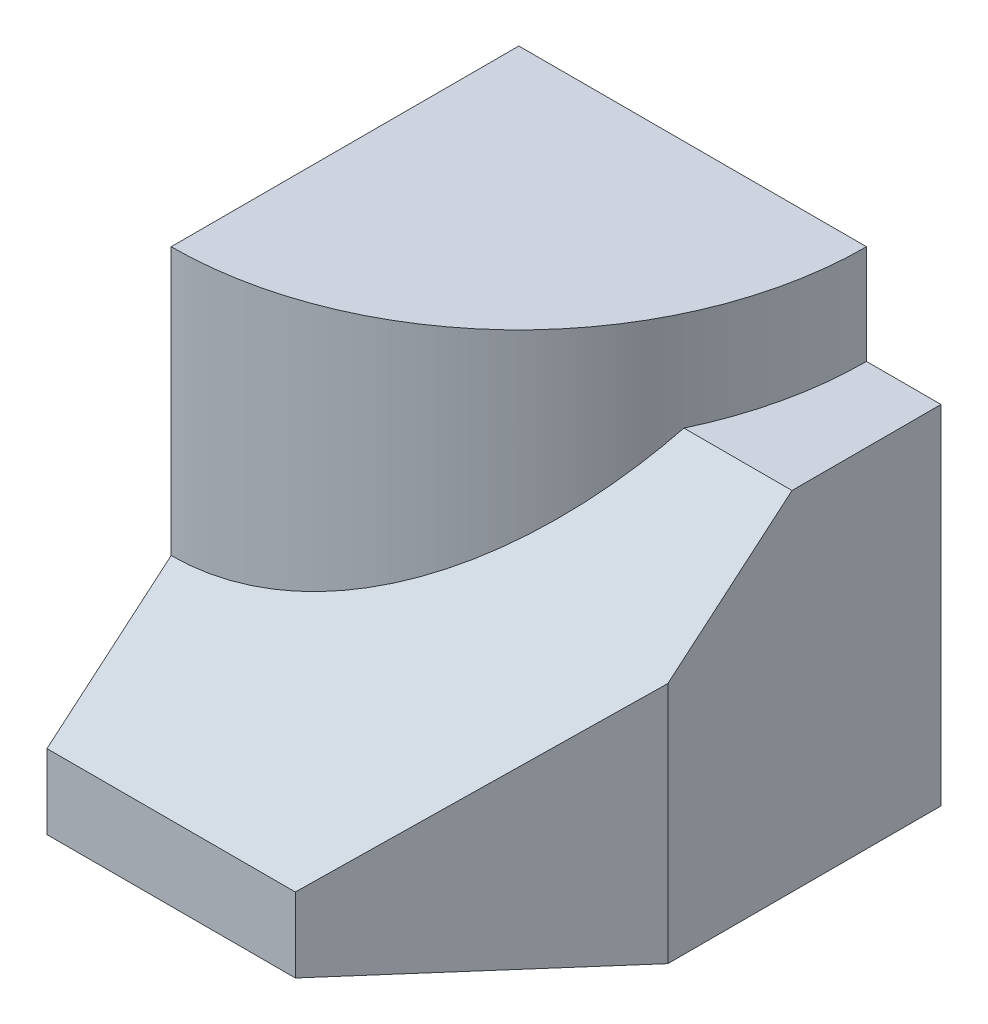
ISO-10303-21;
HEADER;
FILE_DESCRIPTION(('STEP AP214'),'2;1');
FILE_NAME('part.step','',(''),(''),'','','');
FILE_SCHEMA(('AUTOMOTIVE_DESIGN { 1 0 10303 214 1 1 1 1 }'));
ENDSEC;
DATA;
#1=APPLICATION_CONTEXT('core data for automotive mechanical design processes');
#2=APPLICATION_PROTOCOL_DEFINITION('international standard','automotive_design',2000,#1);
#3=PRODUCT_CONTEXT('',#1,'mechanical');
#4=PRODUCT('Part','Part','',(#3));
#5=PRODUCT_RELATED_PRODUCT_CATEGORY('part','',(#4));
#6=PRODUCT_DEFINITION_FORMATION('','',#4);
#7=PRODUCT_DEFINITION_CONTEXT('part definition',#1,'design');
#8=PRODUCT_DEFINITION('design','',#6,#7);
#9=PRODUCT_DEFINITION_SHAPE('','',#8);
#10=(LENGTH_UNIT() NAMED_UNIT(*) SI_UNIT(.MILLI.,.METRE.));
#11=(NAMED_UNIT(*) PLANE_ANGLE_UNIT() SI_UNIT($,.RADIAN.));
#12=(NAMED_UNIT(*) SI_UNIT($,.STERADIAN.) SOLID_ANGLE_UNIT());
#13=UNCERTAINTY_MEASURE_WITH_UNIT(LENGTH_MEASURE(1.E-05),#10,'distance_accuracy_value','');
#14=(GEOMETRIC_REPRESENTATION_CONTEXT(3) GLOBAL_UNCERTAINTY_ASSIGNED_CONTEXT((#13)) GLOBAL_UNIT_ASSIGNED_CONTEXT((#10,
#11,#12)) REPRESENTATION_CONTEXT('',''));
#15=CARTESIAN_POINT('',(0.,0.,0.));
#16=DIRECTION('',(0.,0.,1.));
#17=DIRECTION('',(1.,0.,0.));
#18=AXIS2_PLACEMENT_3D('',#15,#16,#17);
#19=CARTESIAN_POINT('',(0.,0.,0.));
#20=DIRECTION('',(0.,1.,0.));
#21=DIRECTION('',(0.,0.,1.));
#22=AXIS2_PLACEMENT_3D('',#19,#20,#21);
#23=PLANE('',#22);
#24=DIRECTION('',(-0.658504607868518,0.,0.752576694706878));
#25=VECTOR('',#24,1.);
#26=CARTESIAN_POINT('',(85.,0.,55.));
#27=LINE('',#26,#25);
#28=CARTESIAN_POINT('',(85.,0.,55.));
#29=VERTEX_POINT('',#28);
#30=CARTESIAN_POINT('',(50.,0.,95.));
#31=VERTEX_POINT('',#30);
#32=EDGE_CURVE('E46',#29,#31,#27,.T.);
#33=ORIENTED_EDGE('',*,*,#32,.T.);
#34=DIRECTION('',(-1.,0.,0.));
#35=VECTOR('',#34,1.);
#36=CARTESIAN_POINT('',(85.,0.,95.));
#37=LINE('',#36,#35);
#38=CARTESIAN_POINT('',(0.,0.,95.));
#39=VERTEX_POINT('',#38);
#40=EDGE_CURVE('E103',#31,#39,#37,.T.);
#41=ORIENTED_EDGE('',*,*,#40,.T.);
#42=DIRECTION('',(0.,0.,1.));
#43=VECTOR('',#42,1.);
#44=CARTESIAN_POINT('',(0.,0.,0.));
#45=LINE('',#44,#43);
#46=CARTESIAN_POINT('',(0.,0.,0.));
#47=VERTEX_POINT('',#46);
#48=EDGE_CURVE('E124',#47,#39,#45,.T.);
#49=ORIENTED_EDGE('',*,*,#48,.F.);
#50=DIRECTION('',(-1.,0.,0.));
#51=VECTOR('',#50,1.);
#52=CARTESIAN_POINT('',(70.,0.,0.));
#53=LINE('',#52,#51);
#54=CARTESIAN_POINT('',(85.,0.,0.));
#55=VERTEX_POINT('',#54);
#56=EDGE_CURVE('E130',#55,#47,#53,.T.);
#57=ORIENTED_EDGE('',*,*,#56,.F.);
#58=DIRECTION('',(0.,0.,1.));
#59=VECTOR('',#58,1.);
#60=CARTESIAN_POINT('',(85.,0.,95.));
#61=LINE('',#60,#59);
#62=EDGE_CURVE('E106',#55,#29,#61,.T.);
#63=ORIENTED_EDGE('',*,*,#62,.T.);
#64=EDGE_LOOP('',(#33,#41,#49,#57,#63));
#65=FACE_BOUND('',#64,.T.);
#66=ADVANCED_FACE('F31',(#65),#23,.F.);
#67=CARTESIAN_POINT('',(85.,70.,30.));
#68=DIRECTION('',(0.,0.763386285369114,0.645942241466174));
#69=DIRECTION('',(0.,-0.645942241466174,0.763386285369115));
#70=AXIS2_PLACEMENT_3D('',#67,#68,#69);
#71=PLANE('',#70);
#72=DIRECTION('',(-1.,0.,0.));
#73=VECTOR('',#72,1.);
#74=CARTESIAN_POINT('',(85.,15.,95.));
#75=LINE('',#74,#73);
#76=CARTESIAN_POINT('',(50.,15.,95.));
#77=VERTEX_POINT('',#76);
#78=CARTESIAN_POINT('',(0.,15.,95.));
#79=VERTEX_POINT('',#78);
#80=EDGE_CURVE('E112',#77,#79,#75,.T.);
#81=ORIENTED_EDGE('',*,*,#80,.F.);
#82=DIRECTION('',(0.555446259258699,0.537134844118302,-0.634795724867084));
#83=VECTOR('',#82,1.);
#84=CARTESIAN_POINT('',(100.126113036027,63.4736038150591,37.713013673112));
#85=LINE('',#84,#83);
#86=CARTESIAN_POINT('',(85.,48.8461538461539,55.));
#87=VERTEX_POINT('',#86);
#88=EDGE_CURVE('E95',#77,#87,#85,.T.);
#89=ORIENTED_EDGE('',*,*,#88,.T.);
#90=DIRECTION('',(0.,0.645942241466174,-0.763386285369114));
#91=VECTOR('',#90,1.);
#92=CARTESIAN_POINT('',(85.,70.,30.));
#93=LINE('',#92,#91);
#94=CARTESIAN_POINT('',(85.,70.,30.));
#95=VERTEX_POINT('',#94);
#96=EDGE_CURVE('E118',#87,#95,#93,.T.);
#97=ORIENTED_EDGE('',*,*,#96,.T.);
#98=DIRECTION('',(-1.,0.,0.));
#99=VECTOR('',#98,1.);
#100=CARTESIAN_POINT('',(85.,70.,30.));
#101=LINE('',#100,#99);
#102=CARTESIAN_POINT('',(63.2455532033676,70.,30.));
#103=VERTEX_POINT('',#102);
#104=EDGE_CURVE('E115',#95,#103,#101,.T.);
#105=ORIENTED_EDGE('',*,*,#104,.T.);
#106=CARTESIAN_POINT('',(0.,95.3846153846154,0.));
#107=DIRECTION('',(0.,0.763386285369114,0.645942241466174));
#108=DIRECTION('',(0.,-0.645942241466174,0.763386285369115));
#109=AXIS2_PLACEMENT_3D('',#106,#107,#108);
#110=ELLIPSE('',#109,91.6966958165268,70.);
#111=CARTESIAN_POINT('',(0.,36.1538461538462,70.));
#112=VERTEX_POINT('',#111);
#113=EDGE_CURVE('E39',#112,#103,#110,.T.);
#114=ORIENTED_EDGE('',*,*,#113,.F.);
#115=DIRECTION('',(0.,0.645942241466174,-0.763386285369114));
#116=VECTOR('',#115,1.);
#117=CARTESIAN_POINT('',(0.,70.,30.));
#118=LINE('',#117,#116);
#119=EDGE_CURVE('E153',#79,#112,#118,.T.);
#120=ORIENTED_EDGE('',*,*,#119,.F.);
#121=EDGE_LOOP('',(#81,#89,#97,#105,#114,#120));
#122=FACE_BOUND('',#121,.T.);
#123=ADVANCED_FACE('F152',(#122),#71,.T.);
#124=CARTESIAN_POINT('',(85.,15.,95.));
#125=DIRECTION('',(0.,0.,1.));
#126=DIRECTION('',(1.,0.,0.));
#127=AXIS2_PLACEMENT_3D('',#124,#125,#126);
#128=PLANE('',#127);
#129=ORIENTED_EDGE('',*,*,#40,.F.);
#130=DIRECTION('',(0.,-1.,0.));
#131=VECTOR('',#130,1.);
#132=CARTESIAN_POINT('',(50.,90.,95.));
#133=LINE('',#132,#131);
#134=EDGE_CURVE('E92',#77,#31,#133,.T.);
#135=ORIENTED_EDGE('',*,*,#134,.F.);
#136=ORIENTED_EDGE('',*,*,#80,.T.);
#137=DIRECTION('',(0.,1.,0.));
#138=VECTOR('',#137,1.);
#139=CARTESIAN_POINT('',(0.,15.,95.));
#140=LINE('',#139,#138);
#141=EDGE_CURVE('E111',#39,#79,#140,.T.);
#142=ORIENTED_EDGE('',*,*,#141,.F.);
#143=EDGE_LOOP('',(#129,#135,#136,#142));
#144=FACE_BOUND('',#143,.T.);
#145=ADVANCED_FACE('F109',(#144),#128,.T.);
#146=CARTESIAN_POINT('',(85.,70.,0.));
#147=DIRECTION('',(1.,0.,0.));
#148=DIRECTION('',(0.,0.,-1.));
#149=AXIS2_PLACEMENT_3D('',#146,#147,#148);
#150=PLANE('',#149);
#151=ORIENTED_EDGE('',*,*,#96,.F.);
#152=DIRECTION('',(0.,-1.,0.));
#153=VECTOR('',#152,1.);
#154=CARTESIAN_POINT('',(85.,70.,55.));
#155=LINE('',#154,#153);
#156=EDGE_CURVE('E11',#87,#29,#155,.T.);
#157=ORIENTED_EDGE('',*,*,#156,.T.);
#158=ORIENTED_EDGE('',*,*,#62,.F.);
#159=DIRECTION('',(0.,-1.,0.));
#160=VECTOR('',#159,1.);
#161=CARTESIAN_POINT('',(85.,0.,0.));
#162=LINE('',#161,#160);
#163=CARTESIAN_POINT('',(85.,70.,0.));
#164=VERTEX_POINT('',#163);
#165=EDGE_CURVE('E155',#164,#55,#162,.T.);
#166=ORIENTED_EDGE('',*,*,#165,.F.);
#167=DIRECTION('',(0.,0.,-1.));
#168=VECTOR('',#167,1.);
#169=CARTESIAN_POINT('',(85.,70.,0.));
#170=LINE('',#169,#168);
#171=EDGE_CURVE('E113',#95,#164,#170,.T.);
#172=ORIENTED_EDGE('',*,*,#171,.F.);
#173=EDGE_LOOP('',(#151,#157,#158,#166,#172));
#174=FACE_BOUND('',#173,.T.);
#175=ADVANCED_FACE('F171',(#174),#150,.T.);
#176=CARTESIAN_POINT('',(0.,90.,0.));
#177=DIRECTION('',(1.,0.,0.));
#178=DIRECTION('',(0.,0.,-1.));
#179=AXIS2_PLACEMENT_3D('',#176,#177,#178);
#180=PLANE('',#179);
#181=DIRECTION('',(0.,-1.,0.));
#182=VECTOR('',#181,1.);
#183=CARTESIAN_POINT('',(0.,90.,0.));
#184=LINE('',#183,#182);
#185=CARTESIAN_POINT('',(0.,90.,0.));
#186=VERTEX_POINT('',#185);
#187=EDGE_CURVE('E134',#186,#47,#184,.T.);
#188=ORIENTED_EDGE('',*,*,#187,.T.);
#189=ORIENTED_EDGE('',*,*,#48,.T.);
#190=ORIENTED_EDGE('',*,*,#141,.T.);
#191=ORIENTED_EDGE('',*,*,#119,.T.);
#192=DIRECTION('',(0.,-1.,0.));
#193=VECTOR('',#192,1.);
#194=CARTESIAN_POINT('',(0.,90.,70.));
#195=LINE('',#194,#193);
#196=CARTESIAN_POINT('',(0.,90.,70.));
#197=VERTEX_POINT('',#196);
#198=EDGE_CURVE('E142',#197,#112,#195,.T.);
#199=ORIENTED_EDGE('',*,*,#198,.F.);
#200=DIRECTION('',(0.,0.,1.));
#201=VECTOR('',#200,1.);
#202=CARTESIAN_POINT('',(0.,90.,0.));
#203=LINE('',#202,#201);
#204=EDGE_CURVE('E126',#186,#197,#203,.T.);
#205=ORIENTED_EDGE('',*,*,#204,.F.);
#206=EDGE_LOOP('',(#188,#189,#190,#191,#199,#205));
#207=FACE_BOUND('',#206,.T.);
#208=ADVANCED_FACE('F33',(#207),#180,.F.);
#209=CARTESIAN_POINT('',(0.,90.,0.));
#210=DIRECTION('',(0.,-1.,0.));
#211=DIRECTION('',(0.,0.,-1.));
#212=AXIS2_PLACEMENT_3D('',#209,#210,#211);
#213=CYLINDRICAL_SURFACE('',#212,70.);
#214=ORIENTED_EDGE('',*,*,#113,.T.);
#215=CARTESIAN_POINT('',(0.,70.,0.));
#216=DIRECTION('',(0.,1.,0.));
#217=DIRECTION('',(0.,0.,1.));
#218=AXIS2_PLACEMENT_3D('',#215,#216,#217);
#219=CIRCLE('',#218,70.);
#220=CARTESIAN_POINT('',(70.,70.,0.));
#221=VERTEX_POINT('',#220);
#222=EDGE_CURVE('E122',#103,#221,#219,.T.);
#223=ORIENTED_EDGE('',*,*,#222,.T.);
#224=DIRECTION('',(0.,-1.,0.));
#225=VECTOR('',#224,1.);
#226=CARTESIAN_POINT('',(70.,90.,0.));
#227=LINE('',#226,#225);
#228=CARTESIAN_POINT('',(70.,90.,0.));
#229=VERTEX_POINT('',#228);
#230=EDGE_CURVE('E139',#229,#221,#227,.T.);
#231=ORIENTED_EDGE('',*,*,#230,.F.);
#232=CARTESIAN_POINT('',(0.,90.,0.));
#233=DIRECTION('',(0.,1.,0.));
#234=DIRECTION('',(0.,0.,1.));
#235=AXIS2_PLACEMENT_3D('',#232,#233,#234);
#236=CIRCLE('',#235,70.);
#237=EDGE_CURVE('E129',#197,#229,#236,.T.);
#238=ORIENTED_EDGE('',*,*,#237,.F.);
#239=ORIENTED_EDGE('',*,*,#198,.T.);
#240=EDGE_LOOP('',(#214,#223,#231,#238,#239));
#241=FACE_BOUND('',#240,.T.);
#242=ADVANCED_FACE('F144',(#241),#213,.T.);
#243=CARTESIAN_POINT('',(70.,90.,0.));
#244=DIRECTION('',(0.,0.,1.));
#245=DIRECTION('',(1.,0.,0.));
#246=AXIS2_PLACEMENT_3D('',#243,#244,#245);
#247=PLANE('',#246);
#248=ORIENTED_EDGE('',*,*,#230,.T.);
#249=DIRECTION('',(-1.,0.,0.));
#250=VECTOR('',#249,1.);
#251=CARTESIAN_POINT('',(85.,70.,0.));
#252=LINE('',#251,#250);
#253=EDGE_CURVE('E125',#164,#221,#252,.T.);
#254=ORIENTED_EDGE('',*,*,#253,.F.);
#255=ORIENTED_EDGE('',*,*,#165,.T.);
#256=ORIENTED_EDGE('',*,*,#56,.T.);
#257=ORIENTED_EDGE('',*,*,#187,.F.);
#258=DIRECTION('',(-1.,0.,0.));
#259=VECTOR('',#258,1.);
#260=CARTESIAN_POINT('',(70.,90.,0.));
#261=LINE('',#260,#259);
#262=EDGE_CURVE('E132',#229,#186,#261,.T.);
#263=ORIENTED_EDGE('',*,*,#262,.F.);
#264=EDGE_LOOP('',(#248,#254,#255,#256,#257,#263));
#265=FACE_BOUND('',#264,.T.);
#266=ADVANCED_FACE('F167',(#265),#247,.F.);
#267=CARTESIAN_POINT('',(0.,90.,0.));
#268=DIRECTION('',(0.,1.,0.));
#269=DIRECTION('',(0.,0.,1.));
#270=AXIS2_PLACEMENT_3D('',#267,#268,#269);
#271=PLANE('',#270);
#272=ORIENTED_EDGE('',*,*,#204,.T.);
#273=ORIENTED_EDGE('',*,*,#237,.T.);
#274=ORIENTED_EDGE('',*,*,#262,.T.);
#275=EDGE_LOOP('',(#272,#273,#274));
#276=FACE_BOUND('',#275,.T.);
#277=ADVANCED_FACE('F192',(#276),#271,.T.);
#278=CARTESIAN_POINT('',(85.,70.,0.));
#279=DIRECTION('',(0.,1.,0.));
#280=DIRECTION('',(0.,0.,1.));
#281=AXIS2_PLACEMENT_3D('',#278,#279,#280);
#282=PLANE('',#281);
#283=ORIENTED_EDGE('',*,*,#222,.F.);
#284=ORIENTED_EDGE('',*,*,#104,.F.);
#285=ORIENTED_EDGE('',*,*,#171,.T.);
#286=ORIENTED_EDGE('',*,*,#253,.T.);
#287=EDGE_LOOP('',(#283,#284,#285,#286));
#288=FACE_BOUND('',#287,.T.);
#289=ADVANCED_FACE('F163',(#288),#282,.T.);
#290=CARTESIAN_POINT('',(85.,90.,55.));
#291=DIRECTION('',(0.752576694706878,0.,0.658504607868518));
#292=DIRECTION('',(0.658504607868518,0.,-0.752576694706878));
#293=AXIS2_PLACEMENT_3D('',#290,#291,#292);
#294=PLANE('',#293);
#295=ORIENTED_EDGE('',*,*,#134,.T.);
#296=ORIENTED_EDGE('',*,*,#32,.F.);
#297=ORIENTED_EDGE('',*,*,#156,.F.);
#298=ORIENTED_EDGE('',*,*,#88,.F.);
#299=EDGE_LOOP('',(#295,#296,#297,#298));
#300=FACE_BOUND('',#299,.T.);
#301=ADVANCED_FACE('F93',(#300),#294,.T.);
#302=CLOSED_SHELL('',(#66,#123,#145,#175,#208,#242,#266,#277,#289,#301));
#303=MANIFOLD_SOLID_BREP('B2',#302);
#304=ADVANCED_BREP_SHAPE_REPRESENTATION('',(#18,#303),#14);
#305=SHAPE_DEFINITION_REPRESENTATION(#9,#304);
ENDSEC;
END-ISO-10303-21;
